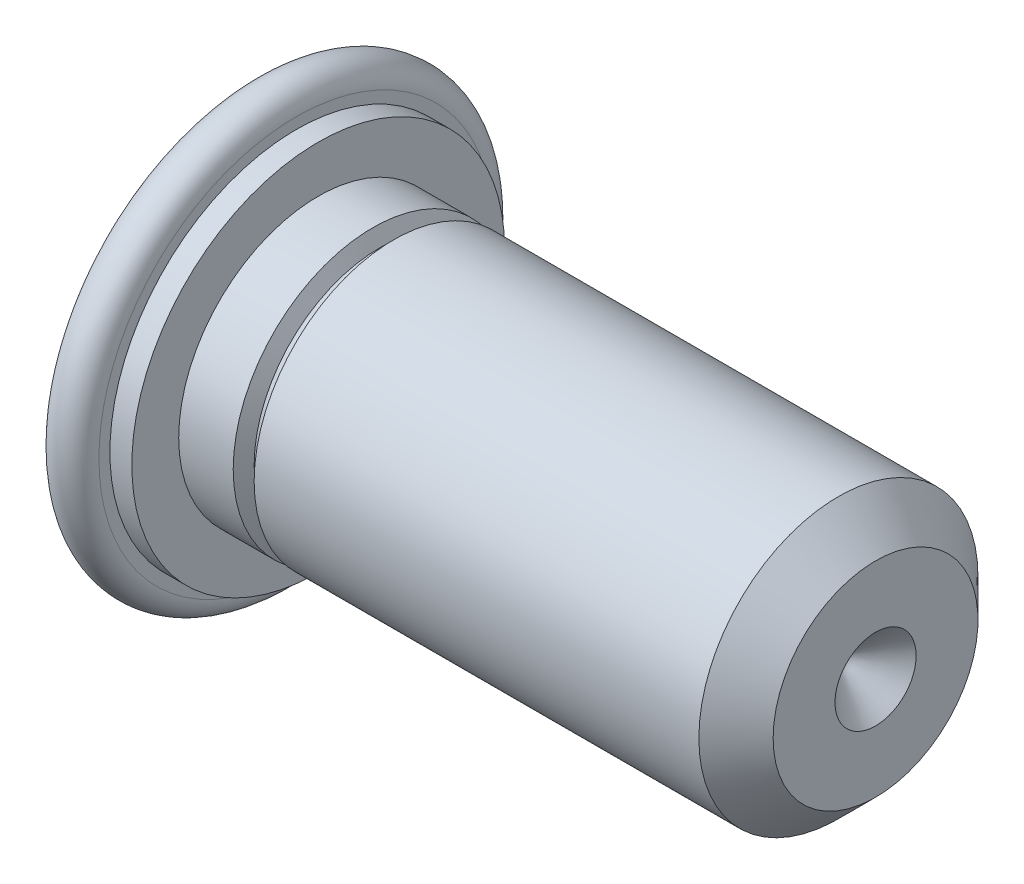
ISO-10303-21;
HEADER;
FILE_DESCRIPTION(('STEP AP214'),'2;1');
FILE_NAME('part.step','',(''),(''),'','','');
FILE_SCHEMA(('AUTOMOTIVE_DESIGN { 1 0 10303 214 1 1 1 1 }'));
ENDSEC;
DATA;
#1=APPLICATION_CONTEXT('core data for automotive mechanical design processes');
#2=APPLICATION_PROTOCOL_DEFINITION('international standard','automotive_design',2000,#1);
#3=PRODUCT_CONTEXT('',#1,'mechanical');
#4=PRODUCT('Part','Part','',(#3));
#5=PRODUCT_RELATED_PRODUCT_CATEGORY('part','',(#4));
#6=PRODUCT_DEFINITION_FORMATION('','',#4);
#7=PRODUCT_DEFINITION_CONTEXT('part definition',#1,'design');
#8=PRODUCT_DEFINITION('design','',#6,#7);
#9=PRODUCT_DEFINITION_SHAPE('','',#8);
#10=(LENGTH_UNIT() NAMED_UNIT(*) SI_UNIT(.MILLI.,.METRE.));
#11=(NAMED_UNIT(*) PLANE_ANGLE_UNIT() SI_UNIT($,.RADIAN.));
#12=(NAMED_UNIT(*) SI_UNIT($,.STERADIAN.) SOLID_ANGLE_UNIT());
#13=UNCERTAINTY_MEASURE_WITH_UNIT(LENGTH_MEASURE(1.E-05),#10,'distance_accuracy_value','');
#14=(GEOMETRIC_REPRESENTATION_CONTEXT(3) GLOBAL_UNCERTAINTY_ASSIGNED_CONTEXT((#13)) GLOBAL_UNIT_ASSIGNED_CONTEXT((#10,
#11,#12)) REPRESENTATION_CONTEXT('',''));
#15=CARTESIAN_POINT('',(0.,0.,0.));
#16=DIRECTION('',(0.,0.,1.));
#17=DIRECTION('',(1.,0.,0.));
#18=AXIS2_PLACEMENT_3D('',#15,#16,#17);
#19=CARTESIAN_POINT('',(0.,0.,1.00584));
#20=DIRECTION('',(-1.,0.,0.));
#21=DIRECTION('',(0.,0.,1.));
#22=AXIS2_PLACEMENT_3D('',#19,#20,#21);
#23=PLANE('',#22);
#24=CARTESIAN_POINT('',(0.,0.,0.));
#25=DIRECTION('',(-1.,0.,0.));
#26=DIRECTION('',(0.,0.,1.));
#27=AXIS2_PLACEMENT_3D('',#24,#25,#26);
#28=CIRCLE('',#27,2.01171369690796);
#29=CARTESIAN_POINT('',(0.,0.,2.01171369690796));
#30=VERTEX_POINT('',#29);
#31=EDGE_CURVE('E21',#30,#30,#28,.F.);
#32=ORIENTED_EDGE('',*,*,#31,.F.);
#33=EDGE_LOOP('',(#32));
#34=FACE_BOUND('',#33,.T.);
#35=ADVANCED_FACE('F17',(#34),#23,.T.);
#36=CARTESIAN_POINT('',(0.223519999999999,0.,0.));
#37=DIRECTION('',(-1.,0.,0.));
#38=DIRECTION('',(0.,0.,1.));
#39=AXIS2_PLACEMENT_3D('',#36,#37,#38);
#40=TOROIDAL_SURFACE('',#39,2.01171369690796,0.22352);
#41=ORIENTED_EDGE('',*,*,#31,.T.);
#42=EDGE_LOOP('',(#41));
#43=FACE_BOUND('',#42,.T.);
#44=CARTESIAN_POINT('',(0.44703999873,0.,-2.01168000000036));
#45=CARTESIAN_POINT('',(0.44703999873,0.383742277746757,-2.01147764941341));
#46=CARTESIAN_POINT('',(0.44703999873,0.74048876533157,-1.87043652948162));
#47=CARTESIAN_POINT('',(0.44703999873,1.12702647373297,-1.71761733381725));
#48=CARTESIAN_POINT('',(0.44703999873,1.42247256957762,-1.42247256957762));
#49=CARTESIAN_POINT('',(0.44703999873,1.7164760242785,-1.12876897510213));
#50=CARTESIAN_POINT('',(0.44703999873,1.87043652948162,-0.74048876533157));
#51=CARTESIAN_POINT('',(0.44703999873,2.01148419796346,-0.384774043341517));
#52=CARTESIAN_POINT('',(0.44703999873,2.01168000000038,0.));
#53=CARTESIAN_POINT('',(0.44703999873,2.01187476586142,0.382737835822086));
#54=CARTESIAN_POINT('',(0.44703999873,1.87043652948163,0.740488765331564));
#55=CARTESIAN_POINT('',(0.44703999873,1.71761732236899,1.12702648519283));
#56=CARTESIAN_POINT('',(0.44703999873,1.42247256957763,1.42247256957762));
#57=CARTESIAN_POINT('',(0.44703999873,1.12876912114791,1.7164758780837));
#58=CARTESIAN_POINT('',(0.44703999873,0.740488765331572,1.87043652948162));
#59=CARTESIAN_POINT('',(0.44703999873,0.384792158579959,2.01147709580225));
#60=CARTESIAN_POINT('',(0.44703999873,0.,2.01168000000034));
#61=B_SPLINE_CURVE_WITH_KNOTS('',2,(#44,#45,#46,#47,#48,#49,#50,#51,#52,#53,#54,#55,#56,#57,#58,
#59,#60),.UNSPECIFIED.,.F.,.F.,(3,2,2,2,2,2,2,2,3),(0.,0.125,0.25,0.375,0.5,0.625,0.75,0.875,
1.),.UNSPECIFIED.);
#62=CARTESIAN_POINT('',(0.447039998095,0.,-2.01168000000081));
#63=VERTEX_POINT('',#62);
#64=CARTESIAN_POINT('',(0.447039998095,0.,2.01168000000068));
#65=VERTEX_POINT('',#64);
#66=EDGE_CURVE('E37',#63,#65,#61,.T.);
#67=ORIENTED_EDGE('',*,*,#66,.F.);
#68=CARTESIAN_POINT('',(0.44703999873,0.,2.01168000000034));
#69=CARTESIAN_POINT('',(0.44703999873,-0.383742277747296,2.01147764941345));
#70=CARTESIAN_POINT('',(0.44703999873,-0.740488765331572,1.87043652948162));
#71=CARTESIAN_POINT('',(0.44703999873,-1.12702647373328,1.71761733381685));
#72=CARTESIAN_POINT('',(0.44703999873,-1.42247256957763,1.42247256957762));
#73=CARTESIAN_POINT('',(0.44703999873,-1.71647602427797,1.12876897510274));
#74=CARTESIAN_POINT('',(0.44703999873,-1.87043652948162,0.740488765331565));
#75=CARTESIAN_POINT('',(0.44703999873,-2.0114841979633,0.384774043342588));
#76=CARTESIAN_POINT('',(0.44703999873,-2.01168000000038,0.));
#77=CARTESIAN_POINT('',(0.44703999873,-2.01187476586159,-0.382737835822093));
#78=CARTESIAN_POINT('',(0.44703999873,-1.87043652948162,-0.740488765331571));
#79=CARTESIAN_POINT('',(0.44703999873,-1.71761732236846,-1.12702648519372));
#80=CARTESIAN_POINT('',(0.44703999873,-1.42247256957762,-1.42247256957762));
#81=CARTESIAN_POINT('',(0.44703999873,-1.12876912114706,-1.71647587808419));
#82=CARTESIAN_POINT('',(0.44703999873,-0.740488765331568,-1.87043652948162));
#83=CARTESIAN_POINT('',(0.44703999873,-0.384792158579622,-2.01147709580224));
#84=CARTESIAN_POINT('',(0.44703999873,0.,-2.01168000000036));
#85=B_SPLINE_CURVE_WITH_KNOTS('',2,(#68,#69,#70,#71,#72,#73,#74,#75,#76,#77,#78,#79,#80,#81,#82,
#83,#84),.UNSPECIFIED.,.F.,.F.,(3,2,2,2,2,2,2,2,3),(0.,0.125,0.25,0.375,0.5,0.625,0.75,0.875,
1.),.UNSPECIFIED.);
#86=EDGE_CURVE('E40',#65,#63,#85,.T.);
#87=ORIENTED_EDGE('',*,*,#86,.F.);
#88=EDGE_LOOP('',(#67,#87));
#89=FACE_BOUND('',#88,.T.);
#90=ADVANCED_FACE('F39',(#43,#89),#40,.T.);
#91=CARTESIAN_POINT('',(0.44703999873,0.,1.71704000000019));
#92=DIRECTION('',(1.,0.,0.));
#93=DIRECTION('',(0.,0.,-1.));
#94=AXIS2_PLACEMENT_3D('',#91,#92,#93);
#95=PLANE('',#94);
#96=CARTESIAN_POINT('',(0.44703999873,0.,0.));
#97=DIRECTION('',(1.,0.,0.));
#98=DIRECTION('',(0.,0.,-1.));
#99=AXIS2_PLACEMENT_3D('',#96,#97,#98);
#100=CIRCLE('',#99,1.89992);
#101=CARTESIAN_POINT('',(0.44703999873,0.,-1.89992));
#102=VERTEX_POINT('',#101);
#103=EDGE_CURVE('E44',#102,#102,#100,.T.);
#104=ORIENTED_EDGE('',*,*,#103,.F.);
#105=EDGE_LOOP('',(#104));
#106=FACE_BOUND('',#105,.T.);
#107=ORIENTED_EDGE('',*,*,#66,.T.);
#108=ORIENTED_EDGE('',*,*,#86,.T.);
#109=EDGE_LOOP('',(#107,#108));
#110=FACE_BOUND('',#109,.T.);
#111=ADVANCED_FACE('F43',(#106,#110),#95,.T.);
#112=CARTESIAN_POINT('',(0.5588,0.,0.));
#113=DIRECTION('',(1.,0.,0.));
#114=DIRECTION('',(0.,0.,-1.));
#115=AXIS2_PLACEMENT_3D('',#112,#113,#114);
#116=CYLINDRICAL_SURFACE('',#115,1.89992);
#117=ORIENTED_EDGE('',*,*,#103,.T.);
#118=EDGE_LOOP('',(#117));
#119=FACE_BOUND('',#118,.T.);
#120=CARTESIAN_POINT('',(0.67056,0.,0.));
#121=DIRECTION('',(1.,0.,0.));
#122=DIRECTION('',(0.,0.,-1.));
#123=AXIS2_PLACEMENT_3D('',#120,#121,#122);
#124=CIRCLE('',#123,1.89992);
#125=CARTESIAN_POINT('',(0.670560000000001,0.,-1.89992));
#126=VERTEX_POINT('',#125);
#127=EDGE_CURVE('E47',#126,#126,#124,.T.);
#128=ORIENTED_EDGE('',*,*,#127,.F.);
#129=EDGE_LOOP('',(#128));
#130=FACE_BOUND('',#129,.T.);
#131=ADVANCED_FACE('F64',(#119,#130),#116,.T.);
#132=CARTESIAN_POINT('',(0.67056,0.,0.));
#133=DIRECTION('',(1.,0.,0.));
#134=DIRECTION('',(0.,0.,-1.));
#135=AXIS2_PLACEMENT_3D('',#132,#133,#134);
#136=PLANE('',#135);
#137=CARTESIAN_POINT('',(0.67056,0.,0.));
#138=DIRECTION('',(-1.,0.,0.));
#139=DIRECTION('',(0.,0.,1.));
#140=AXIS2_PLACEMENT_3D('',#137,#138,#139);
#141=CIRCLE('',#140,1.4224);
#142=CARTESIAN_POINT('',(0.67056,0.,1.4224));
#143=VERTEX_POINT('',#142);
#144=EDGE_CURVE('E116',#143,#143,#141,.F.);
#145=ORIENTED_EDGE('',*,*,#144,.F.);
#146=EDGE_LOOP('',(#145));
#147=FACE_BOUND('',#146,.T.);
#148=ORIENTED_EDGE('',*,*,#127,.T.);
#149=EDGE_LOOP('',(#148));
#150=FACE_BOUND('',#149,.T.);
#151=ADVANCED_FACE('F105',(#147,#150),#136,.T.);
#152=CARTESIAN_POINT('',(3.20929,0.,0.));
#153=DIRECTION('',(-1.,0.,0.));
#154=DIRECTION('',(0.,0.,1.));
#155=AXIS2_PLACEMENT_3D('',#152,#153,#154);
#156=CYLINDRICAL_SURFACE('',#155,1.4224);
#157=ORIENTED_EDGE('',*,*,#144,.T.);
#158=EDGE_LOOP('',(#157));
#159=FACE_BOUND('',#158,.T.);
#160=CARTESIAN_POINT('',(1.22597333427166,0.,0.));
#161=DIRECTION('',(-1.,0.,0.));
#162=DIRECTION('',(0.,0.,1.));
#163=AXIS2_PLACEMENT_3D('',#160,#161,#162);
#164=CIRCLE('',#163,1.42240000042193);
#165=CARTESIAN_POINT('',(1.22597333427166,0.,1.42240000042193));
#166=VERTEX_POINT('',#165);
#167=EDGE_CURVE('E121',#166,#166,#164,.F.);
#168=ORIENTED_EDGE('',*,*,#167,.F.);
#169=EDGE_LOOP('',(#168));
#170=FACE_BOUND('',#169,.T.);
#171=ADVANCED_FACE('F102',(#159,#170),#156,.T.);
#172=CARTESIAN_POINT('',(1.22597333427166,0.,0.));
#173=DIRECTION('',(-1.,0.,0.));
#174=DIRECTION('',(0.,0.,1.));
#175=AXIS2_PLACEMENT_3D('',#172,#173,#174);
#176=CONICAL_SURFACE('',#175,1.42240000042193,1.10714871779409);
#177=ORIENTED_EDGE('',*,*,#167,.T.);
#178=EDGE_LOOP('',(#177));
#179=FACE_BOUND('',#178,.T.);
#180=CARTESIAN_POINT('',(1.29709333460333,0.,0.));
#181=DIRECTION('',(-1.,0.,0.));
#182=DIRECTION('',(0.,0.,1.));
#183=AXIS2_PLACEMENT_3D('',#180,#181,#182);
#184=CIRCLE('',#183,1.2801600021997);
#185=CARTESIAN_POINT('',(1.29709333460333,0.,1.2801600021997));
#186=VERTEX_POINT('',#185);
#187=EDGE_CURVE('E126',#186,#186,#184,.T.);
#188=ORIENTED_EDGE('',*,*,#187,.T.);
#189=EDGE_LOOP('',(#188));
#190=FACE_BOUND('',#189,.T.);
#191=ADVANCED_FACE('F99',(#179,#190),#176,.T.);
#192=CARTESIAN_POINT('',(6.34999999994079,0.,0.));
#193=DIRECTION('',(1.,0.,0.));
#194=DIRECTION('',(0.,0.,-1.));
#195=AXIS2_PLACEMENT_3D('',#192,#193,#194);
#196=CONICAL_SURFACE('',#195,0.41351200002282,0.785398162710123);
#197=CARTESIAN_POINT('',(5.93648799966218,0.,-2.8421709430404E-11));
#198=VERTEX_POINT('',#197);
#199=VERTEX_LOOP('',#198);
#200=FACE_BOUND('',#199,.T.);
#201=CARTESIAN_POINT('',(6.34999999999764,0.,0.));
#202=DIRECTION('',(1.,0.,0.));
#203=DIRECTION('',(0.,0.,-1.));
#204=AXIS2_PLACEMENT_3D('',#201,#202,#203);
#205=CIRCLE('',#204,0.413512000079663);
#206=CARTESIAN_POINT('',(6.34999999999764,0.,-0.413512000079663));
#207=VERTEX_POINT('',#206);
#208=EDGE_CURVE('E123',#207,#207,#205,.F.);
#209=ORIENTED_EDGE('',*,*,#208,.F.);
#210=EDGE_LOOP('',(#209));
#211=FACE_BOUND('',#210,.T.);
#212=ADVANCED_FACE('F96',(#200,#211),#196,.F.);
#213=CARTESIAN_POINT('',(1.33265333333333,0.,0.));
#214=DIRECTION('',(-1.,0.,0.));
#215=DIRECTION('',(0.,0.,1.));
#216=AXIS2_PLACEMENT_3D('',#213,#214,#215);
#217=TOROIDAL_SURFACE('',#216,1.34175172965009,0.0711199999999999);
#218=ORIENTED_EDGE('',*,*,#187,.F.);
#219=EDGE_LOOP('',(#218));
#220=FACE_BOUND('',#219,.T.);
#221=CARTESIAN_POINT('',(1.36821333330772,0.,0.));
#222=DIRECTION('',(1.,0.,0.));
#223=DIRECTION('',(0.,0.,-1.));
#224=AXIS2_PLACEMENT_3D('',#221,#222,#223);
#225=CIRCLE('',#224,1.28015999996478);
#226=CARTESIAN_POINT('',(1.36821333330772,0.,-1.28015999996478));
#227=VERTEX_POINT('',#226);
#228=EDGE_CURVE('E125',#227,#227,#225,.T.);
#229=ORIENTED_EDGE('',*,*,#228,.F.);
#230=EDGE_LOOP('',(#229));
#231=FACE_BOUND('',#230,.T.);
#232=ADVANCED_FACE('F19',(#220,#231),#217,.F.);
#233=CARTESIAN_POINT('',(6.35,0.,0.52197));
#234=DIRECTION('',(1.,0.,0.));
#235=DIRECTION('',(0.,0.,-1.));
#236=AXIS2_PLACEMENT_3D('',#233,#234,#235);
#237=PLANE('',#236);
#238=ORIENTED_EDGE('',*,*,#208,.T.);
#239=EDGE_LOOP('',(#238));
#240=FACE_BOUND('',#239,.T.);
#241=CARTESIAN_POINT('',(6.34999999994079,0.,0.));
#242=DIRECTION('',(-1.,0.,0.));
#243=DIRECTION('',(0.,0.,1.));
#244=AXIS2_PLACEMENT_3D('',#241,#242,#243);
#245=CIRCLE('',#244,1.04394000004504);
#246=CARTESIAN_POINT('',(6.34999999994079,0.,1.04394000004504));
#247=VERTEX_POINT('',#246);
#248=EDGE_CURVE('E53',#247,#247,#245,.T.);
#249=ORIENTED_EDGE('',*,*,#248,.F.);
#250=EDGE_LOOP('',(#249));
#251=FACE_BOUND('',#250,.T.);
#252=ADVANCED_FACE('F91',(#240,#251),#237,.T.);
#253=CARTESIAN_POINT('',(1.43933333345103,0.,0.));
#254=DIRECTION('',(1.,0.,0.));
#255=DIRECTION('',(0.,0.,-1.));
#256=AXIS2_PLACEMENT_3D('',#253,#254,#255);
#257=CONICAL_SURFACE('',#256,1.4224000002514,1.10714871779409);
#258=CARTESIAN_POINT('',(1.43933333333333,0.,0.));
#259=DIRECTION('',(-1.,0.,0.));
#260=DIRECTION('',(0.,0.,1.));
#261=AXIS2_PLACEMENT_3D('',#258,#259,#260);
#262=CIRCLE('',#261,1.4224);
#263=CARTESIAN_POINT('',(1.43933333333333,0.,1.4224));
#264=VERTEX_POINT('',#263);
#265=EDGE_CURVE('E11',#264,#264,#262,.F.);
#266=ORIENTED_EDGE('',*,*,#265,.F.);
#267=EDGE_LOOP('',(#266));
#268=FACE_BOUND('',#267,.T.);
#269=ORIENTED_EDGE('',*,*,#228,.T.);
#270=EDGE_LOOP('',(#269));
#271=FACE_BOUND('',#270,.T.);
#272=ADVANCED_FACE('F84',(#268,#271),#257,.T.);
#273=CARTESIAN_POINT('',(5.97154000007549,0.,0.));
#274=DIRECTION('',(-1.,0.,0.));
#275=DIRECTION('',(0.,0.,1.));
#276=AXIS2_PLACEMENT_3D('',#273,#274,#275);
#277=CONICAL_SURFACE('',#276,1.42239999991034,0.785398163397448);
#278=CARTESIAN_POINT('',(5.97154,0.,0.));
#279=DIRECTION('',(-1.,0.,0.));
#280=DIRECTION('',(0.,0.,1.));
#281=AXIS2_PLACEMENT_3D('',#278,#279,#280);
#282=CIRCLE('',#281,1.4224);
#283=CARTESIAN_POINT('',(5.97154,0.,1.4224));
#284=VERTEX_POINT('',#283);
#285=EDGE_CURVE('E27',#284,#284,#282,.T.);
#286=ORIENTED_EDGE('',*,*,#285,.F.);
#287=EDGE_LOOP('',(#286));
#288=FACE_BOUND('',#287,.T.);
#289=ORIENTED_EDGE('',*,*,#248,.T.);
#290=EDGE_LOOP('',(#289));
#291=FACE_BOUND('',#290,.T.);
#292=ADVANCED_FACE('F78',(#288,#291),#277,.T.);
#293=CARTESIAN_POINT('',(3.20929,0.,0.));
#294=DIRECTION('',(-1.,0.,0.));
#295=DIRECTION('',(0.,0.,1.));
#296=AXIS2_PLACEMENT_3D('',#293,#294,#295);
#297=CYLINDRICAL_SURFACE('',#296,1.4224);
#298=ORIENTED_EDGE('',*,*,#265,.T.);
#299=EDGE_LOOP('',(#298));
#300=FACE_BOUND('',#299,.T.);
#301=ORIENTED_EDGE('',*,*,#285,.T.);
#302=EDGE_LOOP('',(#301));
#303=FACE_BOUND('',#302,.T.);
#304=ADVANCED_FACE('F76',(#300,#303),#297,.T.);
#305=CLOSED_SHELL('',(#35,#90,#111,#131,#151,#171,#191,#212,#232,#252,#272,#292,#304));
#306=MANIFOLD_SOLID_BREP('B1',#305);
#307=ADVANCED_BREP_SHAPE_REPRESENTATION('',(#18,#306),#14);
#308=SHAPE_DEFINITION_REPRESENTATION(#9,#307);
ENDSEC;
END-ISO-10303-21;
